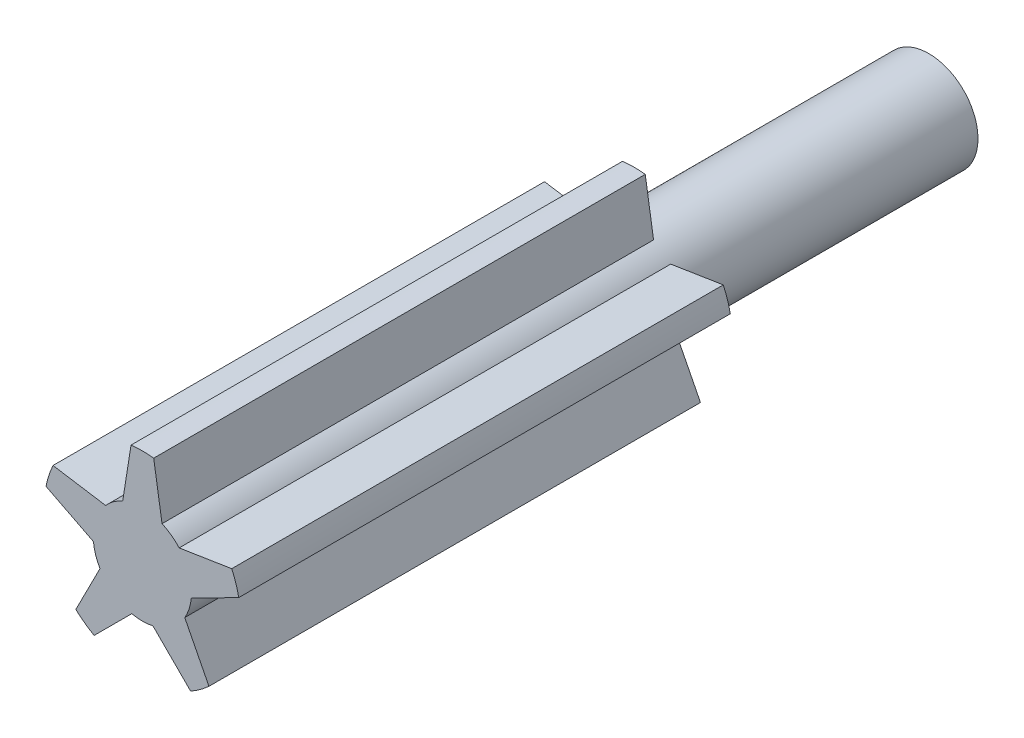
ISO-10303-21;
HEADER;
FILE_DESCRIPTION(('STEP AP214'),'2;1');
FILE_NAME('part.step','',(''),(''),'','','');
FILE_SCHEMA(('AUTOMOTIVE_DESIGN { 1 0 10303 214 1 1 1 1 }'));
ENDSEC;
DATA;
#1=APPLICATION_CONTEXT('core data for automotive mechanical design processes');
#2=APPLICATION_PROTOCOL_DEFINITION('international standard','automotive_design',2000,#1);
#3=PRODUCT_CONTEXT('',#1,'mechanical');
#4=PRODUCT('Part','Part','',(#3));
#5=PRODUCT_RELATED_PRODUCT_CATEGORY('part','',(#4));
#6=PRODUCT_DEFINITION_FORMATION('','',#4);
#7=PRODUCT_DEFINITION_CONTEXT('part definition',#1,'design');
#8=PRODUCT_DEFINITION('design','',#6,#7);
#9=PRODUCT_DEFINITION_SHAPE('','',#8);
#10=(LENGTH_UNIT() NAMED_UNIT(*) SI_UNIT(.MILLI.,.METRE.));
#11=(NAMED_UNIT(*) PLANE_ANGLE_UNIT() SI_UNIT($,.RADIAN.));
#12=(NAMED_UNIT(*) SI_UNIT($,.STERADIAN.) SOLID_ANGLE_UNIT());
#13=UNCERTAINTY_MEASURE_WITH_UNIT(LENGTH_MEASURE(1.E-05),#10,'distance_accuracy_value','');
#14=(GEOMETRIC_REPRESENTATION_CONTEXT(3) GLOBAL_UNCERTAINTY_ASSIGNED_CONTEXT((#13)) GLOBAL_UNIT_ASSIGNED_CONTEXT((#10,
#11,#12)) REPRESENTATION_CONTEXT('',''));
#15=CARTESIAN_POINT('',(0.,0.,0.));
#16=DIRECTION('',(0.,0.,1.));
#17=DIRECTION('',(1.,0.,0.));
#18=AXIS2_PLACEMENT_3D('',#15,#16,#17);
#19=CARTESIAN_POINT('',(0.,0.,30.));
#20=DIRECTION('',(0.,0.,-1.));
#21=DIRECTION('',(-1.,0.,0.));
#22=AXIS2_PLACEMENT_3D('',#19,#20,#21);
#23=CYLINDRICAL_SURFACE('',#22,10.);
#24=CARTESIAN_POINT('',(0.,0.,30.));
#25=DIRECTION('',(0.,0.,1.));
#26=DIRECTION('',(1.,0.,0.));
#27=AXIS2_PLACEMENT_3D('',#24,#25,#26);
#28=CIRCLE('',#27,10.);
#29=CARTESIAN_POINT('',(4.,9.16515138991168,30.));
#30=VERTEX_POINT('',#29);
#31=CARTESIAN_POINT('',(-4.,9.16515138991168,30.));
#32=VERTEX_POINT('',#31);
#33=EDGE_CURVE('E11',#30,#32,#28,.T.);
#34=ORIENTED_EDGE('',*,*,#33,.F.);
#35=DIRECTION('',(0.,0.,-1.));
#36=VECTOR('',#35,1.);
#37=CARTESIAN_POINT('',(4.,9.16515138991168,130.));
#38=LINE('',#37,#36);
#39=CARTESIAN_POINT('',(4.,9.16515138991168,130.));
#40=VERTEX_POINT('',#39);
#41=EDGE_CURVE('E370',#40,#30,#38,.T.);
#42=ORIENTED_EDGE('',*,*,#41,.F.);
#43=CARTESIAN_POINT('',(0.,0.,130.));
#44=DIRECTION('',(0.,0.,1.));
#45=DIRECTION('',(1.,0.,0.));
#46=AXIS2_PLACEMENT_3D('',#43,#44,#45);
#47=CIRCLE('',#46,10.);
#48=CARTESIAN_POINT('',(7.48050897470731,6.63641360068247,130.));
#49=VERTEX_POINT('',#48);
#50=EDGE_CURVE('E277',#49,#40,#47,.T.);
#51=ORIENTED_EDGE('',*,*,#50,.F.);
#52=DIRECTION('',(0.,0.,-1.));
#53=VECTOR('',#52,1.);
#54=CARTESIAN_POINT('',(7.48050897470731,6.63641360068247,130.));
#55=LINE('',#54,#53);
#56=CARTESIAN_POINT('',(7.48050897470731,6.63641360068247,30.));
#57=VERTEX_POINT('',#56);
#58=EDGE_CURVE('E374',#49,#57,#55,.T.);
#59=ORIENTED_EDGE('',*,*,#58,.T.);
#60=CARTESIAN_POINT('',(9.95264492970687,-0.972038529678797,30.));
#61=VERTEX_POINT('',#60);
#62=EDGE_CURVE('E51',#61,#57,#28,.T.);
#63=ORIENTED_EDGE('',*,*,#62,.F.);
#64=DIRECTION('',(0.,0.,-1.));
#65=VECTOR('',#64,1.);
#66=CARTESIAN_POINT('',(9.95264492970687,-0.972038529678797,130.));
#67=LINE('',#66,#65);
#68=CARTESIAN_POINT('',(9.95264492970687,-0.972038529678797,130.));
#69=VERTEX_POINT('',#68);
#70=EDGE_CURVE('E384',#69,#61,#67,.T.);
#71=ORIENTED_EDGE('',*,*,#70,.F.);
#72=CARTESIAN_POINT('',(8.62320879951777,-5.06362222128777,130.));
#73=VERTEX_POINT('',#72);
#74=EDGE_CURVE('E283',#73,#69,#47,.T.);
#75=ORIENTED_EDGE('',*,*,#74,.F.);
#76=DIRECTION('',(0.,0.,-1.));
#77=VECTOR('',#76,1.);
#78=CARTESIAN_POINT('',(8.62320879951777,-5.06362222128777,130.));
#79=LINE('',#78,#77);
#80=CARTESIAN_POINT('',(8.62320879951777,-5.06362222128777,30.));
#81=VERTEX_POINT('',#80);
#82=EDGE_CURVE('E387',#73,#81,#79,.T.);
#83=ORIENTED_EDGE('',*,*,#82,.T.);
#84=CARTESIAN_POINT('',(2.15107284451817,-9.76590423962761,30.));
#85=VERTEX_POINT('',#84);
#86=EDGE_CURVE('E65',#85,#81,#28,.T.);
#87=ORIENTED_EDGE('',*,*,#86,.F.);
#88=DIRECTION('',(0.,0.,-1.));
#89=VECTOR('',#88,1.);
#90=CARTESIAN_POINT('',(2.15107284451817,-9.76590423962761,130.));
#91=LINE('',#90,#89);
#92=CARTESIAN_POINT('',(2.15107284451817,-9.76590423962761,130.));
#93=VERTEX_POINT('',#92);
#94=EDGE_CURVE('E398',#93,#85,#91,.T.);
#95=ORIENTED_EDGE('',*,*,#94,.F.);
#96=CARTESIAN_POINT('',(-2.151072844518,-9.76590423962764,130.));
#97=VERTEX_POINT('',#96);
#98=EDGE_CURVE('E287',#97,#93,#47,.T.);
#99=ORIENTED_EDGE('',*,*,#98,.F.);
#100=DIRECTION('',(0.,0.,-1.));
#101=VECTOR('',#100,1.);
#102=CARTESIAN_POINT('',(-2.151072844518,-9.76590423962764,130.));
#103=LINE('',#102,#101);
#104=CARTESIAN_POINT('',(-2.151072844518,-9.76590423962764,30.));
#105=VERTEX_POINT('',#104);
#106=EDGE_CURVE('E402',#97,#105,#103,.T.);
#107=ORIENTED_EDGE('',*,*,#106,.T.);
#108=CARTESIAN_POINT('',(-8.62320879951768,-5.06362222128792,30.));
#109=VERTEX_POINT('',#108);
#110=EDGE_CURVE('E221',#109,#105,#28,.T.);
#111=ORIENTED_EDGE('',*,*,#110,.F.);
#112=DIRECTION('',(0.,0.,-1.));
#113=VECTOR('',#112,1.);
#114=CARTESIAN_POINT('',(-8.62320879951768,-5.06362222128792,130.));
#115=LINE('',#114,#113);
#116=CARTESIAN_POINT('',(-8.62320879951768,-5.06362222128792,130.));
#117=VERTEX_POINT('',#116);
#118=EDGE_CURVE('E257',#117,#109,#115,.T.);
#119=ORIENTED_EDGE('',*,*,#118,.F.);
#120=CARTESIAN_POINT('',(-9.95264492970686,-0.972038529678851,130.));
#121=VERTEX_POINT('',#120);
#122=EDGE_CURVE('E255',#121,#117,#47,.T.);
#123=ORIENTED_EDGE('',*,*,#122,.F.);
#124=DIRECTION('',(0.,0.,-1.));
#125=VECTOR('',#124,1.);
#126=CARTESIAN_POINT('',(-9.95264492970686,-0.972038529678851,130.));
#127=LINE('',#126,#125);
#128=CARTESIAN_POINT('',(-9.95264492970686,-0.972038529678851,30.));
#129=VERTEX_POINT('',#128);
#130=EDGE_CURVE('E245',#121,#129,#127,.T.);
#131=ORIENTED_EDGE('',*,*,#130,.T.);
#132=CARTESIAN_POINT('',(-7.48050897470737,6.63641360068241,30.));
#133=VERTEX_POINT('',#132);
#134=EDGE_CURVE('E50',#133,#129,#28,.T.);
#135=ORIENTED_EDGE('',*,*,#134,.F.);
#136=DIRECTION('',(0.,0.,-1.));
#137=VECTOR('',#136,1.);
#138=CARTESIAN_POINT('',(-7.48050897470737,6.63641360068241,130.));
#139=LINE('',#138,#137);
#140=CARTESIAN_POINT('',(-7.48050897470737,6.63641360068241,130.));
#141=VERTEX_POINT('',#140);
#142=EDGE_CURVE('E212',#141,#133,#139,.T.);
#143=ORIENTED_EDGE('',*,*,#142,.F.);
#144=CARTESIAN_POINT('',(-4.,9.16515138991168,130.));
#145=VERTEX_POINT('',#144);
#146=EDGE_CURVE('E192',#145,#141,#47,.T.);
#147=ORIENTED_EDGE('',*,*,#146,.F.);
#148=DIRECTION('',(0.,0.,-1.));
#149=VECTOR('',#148,1.);
#150=CARTESIAN_POINT('',(-4.,9.16515138991168,130.));
#151=LINE('',#150,#149);
#152=EDGE_CURVE('E188',#145,#32,#151,.T.);
#153=ORIENTED_EDGE('',*,*,#152,.T.);
#154=EDGE_LOOP('',(#34,#42,#51,#59,#63,#71,#75,#83,#87,#95,#99,#107,#111,#119,#123,#131,#135,
#143,#147,#153));
#155=FACE_BOUND('',#154,.T.);
#156=CARTESIAN_POINT('',(0.,0.,-30.));
#157=DIRECTION('',(0.,0.,1.));
#158=DIRECTION('',(1.,0.,0.));
#159=AXIS2_PLACEMENT_3D('',#156,#157,#158);
#160=CIRCLE('',#159,10.);
#161=CARTESIAN_POINT('',(10.,0.,-30.));
#162=VERTEX_POINT('',#161);
#163=EDGE_CURVE('E44',#162,#162,#160,.T.);
#164=ORIENTED_EDGE('',*,*,#163,.T.);
#165=EDGE_LOOP('',(#164));
#166=FACE_BOUND('',#165,.T.);
#167=ADVANCED_FACE('F41',(#155,#166),#23,.T.);
#168=CARTESIAN_POINT('',(0.,0.,-30.));
#169=DIRECTION('',(0.,0.,1.));
#170=DIRECTION('',(1.,0.,0.));
#171=AXIS2_PLACEMENT_3D('',#168,#169,#170);
#172=PLANE('',#171);
#173=ORIENTED_EDGE('',*,*,#163,.F.);
#174=EDGE_LOOP('',(#173));
#175=FACE_BOUND('',#174,.T.);
#176=ADVANCED_FACE('F439',(#175),#172,.F.);
#177=CARTESIAN_POINT('',(0.,0.,30.));
#178=DIRECTION('',(0.,0.,1.));
#179=DIRECTION('',(1.,0.,0.));
#180=AXIS2_PLACEMENT_3D('',#177,#178,#179);
#181=PLANE('',#180);
#182=DIRECTION('',(0.156434465040224,-0.987688340595139,0.));
#183=VECTOR('',#182,1.);
#184=CARTESIAN_POINT('',(5.3182068003412,0.842321207602146,30.));
#185=LINE('',#184,#183);
#186=CARTESIAN_POINT('',(2.30503708653613,19.8667260521127,30.));
#187=VERTEX_POINT('',#186);
#188=EDGE_CURVE('E202',#187,#30,#185,.T.);
#189=ORIENTED_EDGE('',*,*,#188,.T.);
#190=ORIENTED_EDGE('',*,*,#33,.T.);
#191=DIRECTION('',(-0.156434465040224,-0.987688340595139,0.));
#192=VECTOR('',#191,1.);
#193=CARTESIAN_POINT('',(-5.3182068003412,0.842321207602146,30.));
#194=LINE('',#193,#192);
#195=CARTESIAN_POINT('',(-2.30503708653613,19.8667260521127,30.));
#196=VERTEX_POINT('',#195);
#197=EDGE_CURVE('E332',#196,#32,#194,.T.);
#198=ORIENTED_EDGE('',*,*,#197,.F.);
#199=CARTESIAN_POINT('',(0.,0.,30.));
#200=DIRECTION('',(0.,0.,1.));
#201=DIRECTION('',(1.,0.,0.));
#202=AXIS2_PLACEMENT_3D('',#199,#200,#201);
#203=CIRCLE('',#202,20.);
#204=EDGE_CURVE('E206',#187,#196,#203,.T.);
#205=ORIENTED_EDGE('',*,*,#204,.F.);
#206=EDGE_LOOP('',(#189,#190,#198,#205));
#207=FACE_BOUND('',#206,.T.);
#208=ADVANCED_FACE('F443',(#207),#181,.F.);
#209=DIRECTION('',(0.987688340595137,-0.156434465040238,0.));
#210=VECTOR('',#209,1.);
#211=CARTESIAN_POINT('',(0.842321207602206,5.31820680034109,30.));
#212=LINE('',#211,#210);
#213=CARTESIAN_POINT('',(-18.1820836369083,8.33137651414643,30.));
#214=VERTEX_POINT('',#213);
#215=EDGE_CURVE('E236',#214,#133,#212,.T.);
#216=ORIENTED_EDGE('',*,*,#215,.T.);
#217=ORIENTED_EDGE('',*,*,#134,.T.);
#218=DIRECTION('',(0.891006524188371,-0.45399049973954,0.));
#219=VECTOR('',#218,1.);
#220=CARTESIAN_POINT('',(-2.44451135420951,-4.79762366459829,30.));
#221=LINE('',#220,#219);
#222=CARTESIAN_POINT('',(-19.6066749017167,3.94693543124206,30.));
#223=VERTEX_POINT('',#222);
#224=EDGE_CURVE('E234',#223,#129,#221,.T.);
#225=ORIENTED_EDGE('',*,*,#224,.F.);
#226=CARTESIAN_POINT('',(0.,0.,30.));
#227=DIRECTION('',(0.,0.,1.));
#228=DIRECTION('',(1.,0.,0.));
#229=AXIS2_PLACEMENT_3D('',#226,#227,#228);
#230=CIRCLE('',#229,20.);
#231=EDGE_CURVE('E251',#214,#223,#230,.T.);
#232=ORIENTED_EDGE('',*,*,#231,.F.);
#233=EDGE_LOOP('',(#216,#217,#225,#232));
#234=FACE_BOUND('',#233,.T.);
#235=ADVANCED_FACE('F232',(#234),#181,.F.);
#236=DIRECTION('',(0.453990499739553,0.891006524188365,0.));
#237=VECTOR('',#236,1.);
#238=CARTESIAN_POINT('',(-4.79762366459808,2.44451135420949,30.));
#239=LINE('',#238,#237);
#240=CARTESIAN_POINT('',(-13.5421827604387,-14.7176521932977,30.));
#241=VERTEX_POINT('',#240);
#242=EDGE_CURVE('E250',#241,#109,#239,.T.);
#243=ORIENTED_EDGE('',*,*,#242,.T.);
#244=ORIENTED_EDGE('',*,*,#110,.T.);
#245=DIRECTION('',(0.707106781186543,0.707106781186552,0.));
#246=VECTOR('',#245,1.);
#247=CARTESIAN_POINT('',(3.80741569755481,-3.80741569755475,30.));
#248=LINE('',#247,#246);
#249=CARTESIAN_POINT('',(-9.81255440909423,-17.427385804204,30.));
#250=VERTEX_POINT('',#249);
#251=EDGE_CURVE('E344',#250,#105,#248,.T.);
#252=ORIENTED_EDGE('',*,*,#251,.F.);
#253=CARTESIAN_POINT('',(0.,0.,30.));
#254=DIRECTION('',(0.,0.,1.));
#255=DIRECTION('',(1.,0.,0.));
#256=AXIS2_PLACEMENT_3D('',#253,#254,#255);
#257=CIRCLE('',#256,20.0000000000001);
#258=EDGE_CURVE('E341',#241,#250,#257,.T.);
#259=ORIENTED_EDGE('',*,*,#258,.F.);
#260=EDGE_LOOP('',(#243,#244,#252,#259));
#261=FACE_BOUND('',#260,.T.);
#262=ADVANCED_FACE('F417',(#261),#181,.F.);
#263=DIRECTION('',(-0.707106781186543,0.707106781186552,0.));
#264=VECTOR('',#263,1.);
#265=CARTESIAN_POINT('',(-3.8074156975547,-3.80741569755465,30.));
#266=LINE('',#265,#264);
#267=CARTESIAN_POINT('',(9.81255440909438,-17.4273858042039,30.));
#268=VERTEX_POINT('',#267);
#269=EDGE_CURVE('E347',#268,#85,#266,.T.);
#270=ORIENTED_EDGE('',*,*,#269,.T.);
#271=ORIENTED_EDGE('',*,*,#86,.T.);
#272=DIRECTION('',(-0.453990499739553,0.891006524188365,0.));
#273=VECTOR('',#272,1.);
#274=CARTESIAN_POINT('',(4.79762366459822,2.44451135420956,30.));
#275=LINE('',#274,#273);
#276=CARTESIAN_POINT('',(13.5421827604389,-14.7176521932976,30.));
#277=VERTEX_POINT('',#276);
#278=EDGE_CURVE('E353',#277,#81,#275,.T.);
#279=ORIENTED_EDGE('',*,*,#278,.F.);
#280=CARTESIAN_POINT('',(0.,0.,30.));
#281=DIRECTION('',(0.,0.,1.));
#282=DIRECTION('',(1.,0.,0.));
#283=AXIS2_PLACEMENT_3D('',#280,#281,#282);
#284=CIRCLE('',#283,20.0000000000001);
#285=EDGE_CURVE('E350',#268,#277,#284,.T.);
#286=ORIENTED_EDGE('',*,*,#285,.F.);
#287=EDGE_LOOP('',(#270,#271,#279,#286));
#288=FACE_BOUND('',#287,.T.);
#289=ADVANCED_FACE('F610',(#288),#181,.F.);
#290=DIRECTION('',(-0.891006524188371,-0.453990499739541,0.));
#291=VECTOR('',#290,1.);
#292=CARTESIAN_POINT('',(2.44451135420949,-4.79762366459825,30.));
#293=LINE('',#292,#291);
#294=CARTESIAN_POINT('',(19.6066749017167,3.94693543124214,30.));
#295=VERTEX_POINT('',#294);
#296=EDGE_CURVE('E356',#295,#61,#293,.T.);
#297=ORIENTED_EDGE('',*,*,#296,.T.);
#298=ORIENTED_EDGE('',*,*,#62,.T.);
#299=DIRECTION('',(-0.987688340595137,-0.156434465040238,0.));
#300=VECTOR('',#299,1.);
#301=CARTESIAN_POINT('',(-0.842321207602215,5.31820680034116,30.));
#302=LINE('',#301,#300);
#303=CARTESIAN_POINT('',(18.1820836369084,8.3313765141465,30.));
#304=VERTEX_POINT('',#303);
#305=EDGE_CURVE('E362',#304,#57,#302,.T.);
#306=ORIENTED_EDGE('',*,*,#305,.F.);
#307=CARTESIAN_POINT('',(0.,0.,30.));
#308=DIRECTION('',(0.,0.,1.));
#309=DIRECTION('',(1.,0.,0.));
#310=AXIS2_PLACEMENT_3D('',#307,#308,#309);
#311=CIRCLE('',#310,20.0000000000001);
#312=EDGE_CURVE('E359',#295,#304,#311,.T.);
#313=ORIENTED_EDGE('',*,*,#312,.F.);
#314=EDGE_LOOP('',(#297,#298,#306,#313));
#315=FACE_BOUND('',#314,.T.);
#316=ADVANCED_FACE('F450',(#315),#181,.F.);
#317=CARTESIAN_POINT('',(0.,0.,130.));
#318=DIRECTION('',(0.,0.,-1.));
#319=DIRECTION('',(-1.,0.,0.));
#320=AXIS2_PLACEMENT_3D('',#317,#318,#319);
#321=CYLINDRICAL_SURFACE('',#320,20.);
#322=ORIENTED_EDGE('',*,*,#204,.T.);
#323=DIRECTION('',(0.,0.,-1.));
#324=VECTOR('',#323,1.);
#325=CARTESIAN_POINT('',(-2.30503708653613,19.8667260521127,130.));
#326=LINE('',#325,#324);
#327=CARTESIAN_POINT('',(-2.30503708653613,19.8667260521127,130.));
#328=VERTEX_POINT('',#327);
#329=EDGE_CURVE('E185',#328,#196,#326,.T.);
#330=ORIENTED_EDGE('',*,*,#329,.F.);
#331=CARTESIAN_POINT('',(0.,0.,130.));
#332=DIRECTION('',(0.,0.,1.));
#333=DIRECTION('',(1.,0.,0.));
#334=AXIS2_PLACEMENT_3D('',#331,#332,#333);
#335=CIRCLE('',#334,20.);
#336=CARTESIAN_POINT('',(2.30503708653613,19.8667260521127,130.));
#337=VERTEX_POINT('',#336);
#338=EDGE_CURVE('E193',#337,#328,#335,.T.);
#339=ORIENTED_EDGE('',*,*,#338,.F.);
#340=DIRECTION('',(0.,0.,-1.));
#341=VECTOR('',#340,1.);
#342=CARTESIAN_POINT('',(2.30503708653613,19.8667260521127,130.));
#343=LINE('',#342,#341);
#344=EDGE_CURVE('E329',#337,#187,#343,.T.);
#345=ORIENTED_EDGE('',*,*,#344,.T.);
#346=EDGE_LOOP('',(#322,#330,#339,#345));
#347=FACE_BOUND('',#346,.T.);
#348=ADVANCED_FACE('F204',(#347),#321,.T.);
#349=CARTESIAN_POINT('',(-5.3182068003412,0.842321207602146,130.));
#350=DIRECTION('',(0.987688340595139,-0.156434465040224,0.));
#351=DIRECTION('',(0.156434465040224,0.987688340595139,0.));
#352=AXIS2_PLACEMENT_3D('',#349,#350,#351);
#353=PLANE('',#352);
#354=ORIENTED_EDGE('',*,*,#197,.T.);
#355=ORIENTED_EDGE('',*,*,#152,.F.);
#356=DIRECTION('',(-0.156434465040224,-0.987688340595139,0.));
#357=VECTOR('',#356,1.);
#358=CARTESIAN_POINT('',(-5.3182068003412,0.842321207602146,130.));
#359=LINE('',#358,#357);
#360=EDGE_CURVE('E180',#328,#145,#359,.T.);
#361=ORIENTED_EDGE('',*,*,#360,.F.);
#362=ORIENTED_EDGE('',*,*,#329,.T.);
#363=EDGE_LOOP('',(#354,#355,#361,#362));
#364=FACE_BOUND('',#363,.T.);
#365=ADVANCED_FACE('F183',(#364),#353,.F.);
#366=CARTESIAN_POINT('',(0.842321207602206,5.31820680034109,130.));
#367=DIRECTION('',(0.156434465040238,0.987688340595137,0.));
#368=DIRECTION('',(-0.987688340595137,0.156434465040238,0.));
#369=AXIS2_PLACEMENT_3D('',#366,#367,#368);
#370=PLANE('',#369);
#371=ORIENTED_EDGE('',*,*,#215,.F.);
#372=DIRECTION('',(0.,0.,-1.));
#373=VECTOR('',#372,1.);
#374=CARTESIAN_POINT('',(-18.1820836369083,8.33137651414643,130.));
#375=LINE('',#374,#373);
#376=CARTESIAN_POINT('',(-18.1820836369083,8.33137651414643,130.));
#377=VERTEX_POINT('',#376);
#378=EDGE_CURVE('E261',#377,#214,#375,.T.);
#379=ORIENTED_EDGE('',*,*,#378,.F.);
#380=DIRECTION('',(0.987688340595137,-0.156434465040238,0.));
#381=VECTOR('',#380,1.);
#382=CARTESIAN_POINT('',(0.842321207602206,5.31820680034109,130.));
#383=LINE('',#382,#381);
#384=EDGE_CURVE('E274',#377,#141,#383,.T.);
#385=ORIENTED_EDGE('',*,*,#384,.T.);
#386=ORIENTED_EDGE('',*,*,#142,.T.);
#387=EDGE_LOOP('',(#371,#379,#385,#386));
#388=FACE_BOUND('',#387,.T.);
#389=ADVANCED_FACE('F272',(#388),#370,.T.);
#390=CARTESIAN_POINT('',(0.,0.,130.));
#391=DIRECTION('',(0.,0.,-1.));
#392=DIRECTION('',(-1.,0.,0.));
#393=AXIS2_PLACEMENT_3D('',#390,#391,#392);
#394=CYLINDRICAL_SURFACE('',#393,20.);
#395=ORIENTED_EDGE('',*,*,#231,.T.);
#396=DIRECTION('',(0.,0.,-1.));
#397=VECTOR('',#396,1.);
#398=CARTESIAN_POINT('',(-19.6066749017167,3.94693543124206,130.));
#399=LINE('',#398,#397);
#400=CARTESIAN_POINT('',(-19.6066749017167,3.94693543124206,130.));
#401=VERTEX_POINT('',#400);
#402=EDGE_CURVE('E248',#401,#223,#399,.T.);
#403=ORIENTED_EDGE('',*,*,#402,.F.);
#404=CARTESIAN_POINT('',(0.,0.,130.));
#405=DIRECTION('',(0.,0.,1.));
#406=DIRECTION('',(1.,0.,0.));
#407=AXIS2_PLACEMENT_3D('',#404,#405,#406);
#408=CIRCLE('',#407,20.);
#409=EDGE_CURVE('E279',#377,#401,#408,.T.);
#410=ORIENTED_EDGE('',*,*,#409,.F.);
#411=ORIENTED_EDGE('',*,*,#378,.T.);
#412=EDGE_LOOP('',(#395,#403,#410,#411));
#413=FACE_BOUND('',#412,.T.);
#414=ADVANCED_FACE('F429',(#413),#394,.T.);
#415=CARTESIAN_POINT('',(-2.44451135420951,-4.79762366459829,130.));
#416=DIRECTION('',(0.453990499739541,0.891006524188371,0.));
#417=DIRECTION('',(-0.891006524188371,0.453990499739541,0.));
#418=AXIS2_PLACEMENT_3D('',#415,#416,#417);
#419=PLANE('',#418);
#420=ORIENTED_EDGE('',*,*,#224,.T.);
#421=ORIENTED_EDGE('',*,*,#130,.F.);
#422=DIRECTION('',(0.891006524188371,-0.45399049973954,0.));
#423=VECTOR('',#422,1.);
#424=CARTESIAN_POINT('',(-2.44451135420951,-4.79762366459829,130.));
#425=LINE('',#424,#423);
#426=EDGE_CURVE('E286',#401,#121,#425,.T.);
#427=ORIENTED_EDGE('',*,*,#426,.F.);
#428=ORIENTED_EDGE('',*,*,#402,.T.);
#429=EDGE_LOOP('',(#420,#421,#427,#428));
#430=FACE_BOUND('',#429,.T.);
#431=ADVANCED_FACE('F243',(#430),#419,.F.);
#432=CARTESIAN_POINT('',(-4.79762366459808,2.44451135420949,130.));
#433=DIRECTION('',(-0.891006524188365,0.453990499739553,0.));
#434=DIRECTION('',(-0.453990499739553,-0.891006524188365,0.));
#435=AXIS2_PLACEMENT_3D('',#432,#433,#434);
#436=PLANE('',#435);
#437=ORIENTED_EDGE('',*,*,#242,.F.);
#438=DIRECTION('',(0.,0.,-1.));
#439=VECTOR('',#438,1.);
#440=CARTESIAN_POINT('',(-13.5421827604387,-14.7176521932977,130.));
#441=LINE('',#440,#439);
#442=CARTESIAN_POINT('',(-13.5421827604387,-14.7176521932977,130.));
#443=VERTEX_POINT('',#442);
#444=EDGE_CURVE('E264',#443,#241,#441,.T.);
#445=ORIENTED_EDGE('',*,*,#444,.F.);
#446=DIRECTION('',(0.453990499739553,0.891006524188365,0.));
#447=VECTOR('',#446,1.);
#448=CARTESIAN_POINT('',(-4.79762366459808,2.44451135420949,130.));
#449=LINE('',#448,#447);
#450=EDGE_CURVE('E285',#443,#117,#449,.T.);
#451=ORIENTED_EDGE('',*,*,#450,.T.);
#452=ORIENTED_EDGE('',*,*,#118,.T.);
#453=EDGE_LOOP('',(#437,#445,#451,#452));
#454=FACE_BOUND('',#453,.T.);
#455=ADVANCED_FACE('F418',(#454),#436,.T.);
#456=CARTESIAN_POINT('',(0.,0.,130.));
#457=DIRECTION('',(0.,0.,-1.));
#458=DIRECTION('',(-1.,0.,0.));
#459=AXIS2_PLACEMENT_3D('',#456,#457,#458);
#460=CYLINDRICAL_SURFACE('',#459,20.0000000000001);
#461=ORIENTED_EDGE('',*,*,#258,.T.);
#462=DIRECTION('',(0.,0.,-1.));
#463=VECTOR('',#462,1.);
#464=CARTESIAN_POINT('',(-9.81255440909423,-17.427385804204,130.));
#465=LINE('',#464,#463);
#466=CARTESIAN_POINT('',(-9.81255440909423,-17.427385804204,130.));
#467=VERTEX_POINT('',#466);
#468=EDGE_CURVE('E406',#467,#250,#465,.T.);
#469=ORIENTED_EDGE('',*,*,#468,.F.);
#470=CARTESIAN_POINT('',(0.,0.,130.));
#471=DIRECTION('',(0.,0.,1.));
#472=DIRECTION('',(1.,0.,0.));
#473=AXIS2_PLACEMENT_3D('',#470,#471,#472);
#474=CIRCLE('',#473,20.0000000000001);
#475=EDGE_CURVE('E292',#443,#467,#474,.T.);
#476=ORIENTED_EDGE('',*,*,#475,.F.);
#477=ORIENTED_EDGE('',*,*,#444,.T.);
#478=EDGE_LOOP('',(#461,#469,#476,#477));
#479=FACE_BOUND('',#478,.T.);
#480=ADVANCED_FACE('F413',(#479),#460,.T.);
#481=CARTESIAN_POINT('',(3.80741569755481,-3.80741569755475,130.));
#482=DIRECTION('',(-0.707106781186552,0.707106781186543,0.));
#483=DIRECTION('',(-0.707106781186543,-0.707106781186552,0.));
#484=AXIS2_PLACEMENT_3D('',#481,#482,#483);
#485=PLANE('',#484);
#486=ORIENTED_EDGE('',*,*,#251,.T.);
#487=ORIENTED_EDGE('',*,*,#106,.F.);
#488=DIRECTION('',(0.707106781186543,0.707106781186552,0.));
#489=VECTOR('',#488,1.);
#490=CARTESIAN_POINT('',(3.80741569755481,-3.80741569755475,130.));
#491=LINE('',#490,#489);
#492=EDGE_CURVE('E297',#467,#97,#491,.T.);
#493=ORIENTED_EDGE('',*,*,#492,.F.);
#494=ORIENTED_EDGE('',*,*,#468,.T.);
#495=EDGE_LOOP('',(#486,#487,#493,#494));
#496=FACE_BOUND('',#495,.T.);
#497=ADVANCED_FACE('F422',(#496),#485,.F.);
#498=CARTESIAN_POINT('',(-3.8074156975547,-3.80741569755465,130.));
#499=DIRECTION('',(-0.707106781186552,-0.707106781186543,0.));
#500=DIRECTION('',(0.707106781186543,-0.707106781186552,0.));
#501=AXIS2_PLACEMENT_3D('',#498,#499,#500);
#502=PLANE('',#501);
#503=ORIENTED_EDGE('',*,*,#269,.F.);
#504=DIRECTION('',(0.,0.,-1.));
#505=VECTOR('',#504,1.);
#506=CARTESIAN_POINT('',(9.81255440909438,-17.4273858042039,130.));
#507=LINE('',#506,#505);
#508=CARTESIAN_POINT('',(9.81255440909438,-17.4273858042039,130.));
#509=VERTEX_POINT('',#508);
#510=EDGE_CURVE('E395',#509,#268,#507,.T.);
#511=ORIENTED_EDGE('',*,*,#510,.F.);
#512=DIRECTION('',(-0.707106781186543,0.707106781186552,0.));
#513=VECTOR('',#512,1.);
#514=CARTESIAN_POINT('',(-3.8074156975547,-3.80741569755465,130.));
#515=LINE('',#514,#513);
#516=EDGE_CURVE('E296',#509,#93,#515,.T.);
#517=ORIENTED_EDGE('',*,*,#516,.T.);
#518=ORIENTED_EDGE('',*,*,#94,.T.);
#519=EDGE_LOOP('',(#503,#511,#517,#518));
#520=FACE_BOUND('',#519,.T.);
#521=ADVANCED_FACE('F500',(#520),#502,.T.);
#522=CARTESIAN_POINT('',(0.,0.,130.));
#523=DIRECTION('',(0.,0.,-1.));
#524=DIRECTION('',(-1.,0.,0.));
#525=AXIS2_PLACEMENT_3D('',#522,#523,#524);
#526=CYLINDRICAL_SURFACE('',#525,20.0000000000001);
#527=ORIENTED_EDGE('',*,*,#285,.T.);
#528=DIRECTION('',(0.,0.,-1.));
#529=VECTOR('',#528,1.);
#530=CARTESIAN_POINT('',(13.5421827604389,-14.7176521932976,130.));
#531=LINE('',#530,#529);
#532=CARTESIAN_POINT('',(13.5421827604389,-14.7176521932976,130.));
#533=VERTEX_POINT('',#532);
#534=EDGE_CURVE('E391',#533,#277,#531,.T.);
#535=ORIENTED_EDGE('',*,*,#534,.F.);
#536=CARTESIAN_POINT('',(0.,0.,130.));
#537=DIRECTION('',(0.,0.,1.));
#538=DIRECTION('',(1.,0.,0.));
#539=AXIS2_PLACEMENT_3D('',#536,#537,#538);
#540=CIRCLE('',#539,20.0000000000001);
#541=EDGE_CURVE('E304',#509,#533,#540,.T.);
#542=ORIENTED_EDGE('',*,*,#541,.F.);
#543=ORIENTED_EDGE('',*,*,#510,.T.);
#544=EDGE_LOOP('',(#527,#535,#542,#543));
#545=FACE_BOUND('',#544,.T.);
#546=ADVANCED_FACE('F509',(#545),#526,.T.);
#547=CARTESIAN_POINT('',(4.79762366459822,2.44451135420956,130.));
#548=DIRECTION('',(-0.891006524188365,-0.453990499739553,0.));
#549=DIRECTION('',(0.453990499739553,-0.891006524188365,0.));
#550=AXIS2_PLACEMENT_3D('',#547,#548,#549);
#551=PLANE('',#550);
#552=ORIENTED_EDGE('',*,*,#278,.T.);
#553=ORIENTED_EDGE('',*,*,#82,.F.);
#554=DIRECTION('',(-0.453990499739553,0.891006524188365,0.));
#555=VECTOR('',#554,1.);
#556=CARTESIAN_POINT('',(4.79762366459822,2.44451135420956,130.));
#557=LINE('',#556,#555);
#558=EDGE_CURVE('E309',#533,#73,#557,.T.);
#559=ORIENTED_EDGE('',*,*,#558,.F.);
#560=ORIENTED_EDGE('',*,*,#534,.T.);
#561=EDGE_LOOP('',(#552,#553,#559,#560));
#562=FACE_BOUND('',#561,.T.);
#563=ADVANCED_FACE('F519',(#562),#551,.F.);
#564=CARTESIAN_POINT('',(2.44451135420949,-4.79762366459825,130.));
#565=DIRECTION('',(0.453990499739541,-0.891006524188371,0.));
#566=DIRECTION('',(0.891006524188371,0.453990499739541,0.));
#567=AXIS2_PLACEMENT_3D('',#564,#565,#566);
#568=PLANE('',#567);
#569=ORIENTED_EDGE('',*,*,#296,.F.);
#570=DIRECTION('',(0.,0.,-1.));
#571=VECTOR('',#570,1.);
#572=CARTESIAN_POINT('',(19.6066749017167,3.94693543124214,130.));
#573=LINE('',#572,#571);
#574=CARTESIAN_POINT('',(19.6066749017167,3.94693543124214,130.));
#575=VERTEX_POINT('',#574);
#576=EDGE_CURVE('E381',#575,#295,#573,.T.);
#577=ORIENTED_EDGE('',*,*,#576,.F.);
#578=DIRECTION('',(-0.891006524188371,-0.453990499739541,0.));
#579=VECTOR('',#578,1.);
#580=CARTESIAN_POINT('',(2.44451135420949,-4.79762366459825,130.));
#581=LINE('',#580,#579);
#582=EDGE_CURVE('E308',#575,#69,#581,.T.);
#583=ORIENTED_EDGE('',*,*,#582,.T.);
#584=ORIENTED_EDGE('',*,*,#70,.T.);
#585=EDGE_LOOP('',(#569,#577,#583,#584));
#586=FACE_BOUND('',#585,.T.);
#587=ADVANCED_FACE('F529',(#586),#568,.T.);
#588=CARTESIAN_POINT('',(0.,0.,130.));
#589=DIRECTION('',(0.,0.,-1.));
#590=DIRECTION('',(-1.,0.,0.));
#591=AXIS2_PLACEMENT_3D('',#588,#589,#590);
#592=CYLINDRICAL_SURFACE('',#591,20.0000000000001);
#593=ORIENTED_EDGE('',*,*,#312,.T.);
#594=DIRECTION('',(0.,0.,-1.));
#595=VECTOR('',#594,1.);
#596=CARTESIAN_POINT('',(18.1820836369084,8.3313765141465,130.));
#597=LINE('',#596,#595);
#598=CARTESIAN_POINT('',(18.1820836369084,8.3313765141465,130.));
#599=VERTEX_POINT('',#598);
#600=EDGE_CURVE('E377',#599,#304,#597,.T.);
#601=ORIENTED_EDGE('',*,*,#600,.F.);
#602=CARTESIAN_POINT('',(0.,0.,130.));
#603=DIRECTION('',(0.,0.,1.));
#604=DIRECTION('',(1.,0.,0.));
#605=AXIS2_PLACEMENT_3D('',#602,#603,#604);
#606=CIRCLE('',#605,20.0000000000001);
#607=EDGE_CURVE('E315',#575,#599,#606,.T.);
#608=ORIENTED_EDGE('',*,*,#607,.F.);
#609=ORIENTED_EDGE('',*,*,#576,.T.);
#610=EDGE_LOOP('',(#593,#601,#608,#609));
#611=FACE_BOUND('',#610,.T.);
#612=ADVANCED_FACE('F539',(#611),#592,.T.);
#613=CARTESIAN_POINT('',(-0.842321207602215,5.31820680034116,130.));
#614=DIRECTION('',(0.156434465040238,-0.987688340595137,0.));
#615=DIRECTION('',(0.987688340595137,0.156434465040238,0.));
#616=AXIS2_PLACEMENT_3D('',#613,#614,#615);
#617=PLANE('',#616);
#618=ORIENTED_EDGE('',*,*,#305,.T.);
#619=ORIENTED_EDGE('',*,*,#58,.F.);
#620=DIRECTION('',(-0.987688340595137,-0.156434465040238,0.));
#621=VECTOR('',#620,1.);
#622=CARTESIAN_POINT('',(-0.842321207602215,5.31820680034116,130.));
#623=LINE('',#622,#621);
#624=EDGE_CURVE('E282',#599,#49,#623,.T.);
#625=ORIENTED_EDGE('',*,*,#624,.F.);
#626=ORIENTED_EDGE('',*,*,#600,.T.);
#627=EDGE_LOOP('',(#618,#619,#625,#626));
#628=FACE_BOUND('',#627,.T.);
#629=ADVANCED_FACE('F549',(#628),#617,.F.);
#630=CARTESIAN_POINT('',(5.3182068003412,0.842321207602146,130.));
#631=DIRECTION('',(0.987688340595139,0.156434465040224,0.));
#632=DIRECTION('',(-0.156434465040224,0.987688340595139,0.));
#633=AXIS2_PLACEMENT_3D('',#630,#631,#632);
#634=PLANE('',#633);
#635=ORIENTED_EDGE('',*,*,#188,.F.);
#636=ORIENTED_EDGE('',*,*,#344,.F.);
#637=DIRECTION('',(0.156434465040224,-0.987688340595139,0.));
#638=VECTOR('',#637,1.);
#639=CARTESIAN_POINT('',(5.3182068003412,0.842321207602146,130.));
#640=LINE('',#639,#638);
#641=EDGE_CURVE('E199',#337,#40,#640,.T.);
#642=ORIENTED_EDGE('',*,*,#641,.T.);
#643=ORIENTED_EDGE('',*,*,#41,.T.);
#644=EDGE_LOOP('',(#635,#636,#642,#643));
#645=FACE_BOUND('',#644,.T.);
#646=ADVANCED_FACE('F559',(#645),#634,.T.);
#647=CARTESIAN_POINT('',(0.,0.,130.));
#648=DIRECTION('',(0.,0.,1.));
#649=DIRECTION('',(1.,0.,0.));
#650=AXIS2_PLACEMENT_3D('',#647,#648,#649);
#651=PLANE('',#650);
#652=ORIENTED_EDGE('',*,*,#338,.T.);
#653=ORIENTED_EDGE('',*,*,#360,.T.);
#654=ORIENTED_EDGE('',*,*,#146,.T.);
#655=ORIENTED_EDGE('',*,*,#384,.F.);
#656=ORIENTED_EDGE('',*,*,#409,.T.);
#657=ORIENTED_EDGE('',*,*,#426,.T.);
#658=ORIENTED_EDGE('',*,*,#122,.T.);
#659=ORIENTED_EDGE('',*,*,#450,.F.);
#660=ORIENTED_EDGE('',*,*,#475,.T.);
#661=ORIENTED_EDGE('',*,*,#492,.T.);
#662=ORIENTED_EDGE('',*,*,#98,.T.);
#663=ORIENTED_EDGE('',*,*,#516,.F.);
#664=ORIENTED_EDGE('',*,*,#541,.T.);
#665=ORIENTED_EDGE('',*,*,#558,.T.);
#666=ORIENTED_EDGE('',*,*,#74,.T.);
#667=ORIENTED_EDGE('',*,*,#582,.F.);
#668=ORIENTED_EDGE('',*,*,#607,.T.);
#669=ORIENTED_EDGE('',*,*,#624,.T.);
#670=ORIENTED_EDGE('',*,*,#50,.T.);
#671=ORIENTED_EDGE('',*,*,#641,.F.);
#672=EDGE_LOOP('',(#652,#653,#654,#655,#656,#657,#658,#659,#660,#661,#662,#663,#664,#665,#666,
#667,#668,#669,#670,#671));
#673=FACE_BOUND('',#672,.T.);
#674=ADVANCED_FACE('F197',(#673),#651,.T.);
#675=CLOSED_SHELL('',(#167,#176,#208,#235,#262,#289,#316,#348,#365,#389,#414,#431,#455,#480,
#497,#521,#546,#563,#587,#612,#629,#646,#674));
#676=MANIFOLD_SOLID_BREP('B2',#675);
#677=ADVANCED_BREP_SHAPE_REPRESENTATION('',(#18,#676),#14);
#678=SHAPE_DEFINITION_REPRESENTATION(#9,#677);
ENDSEC;
END-ISO-10303-21;
